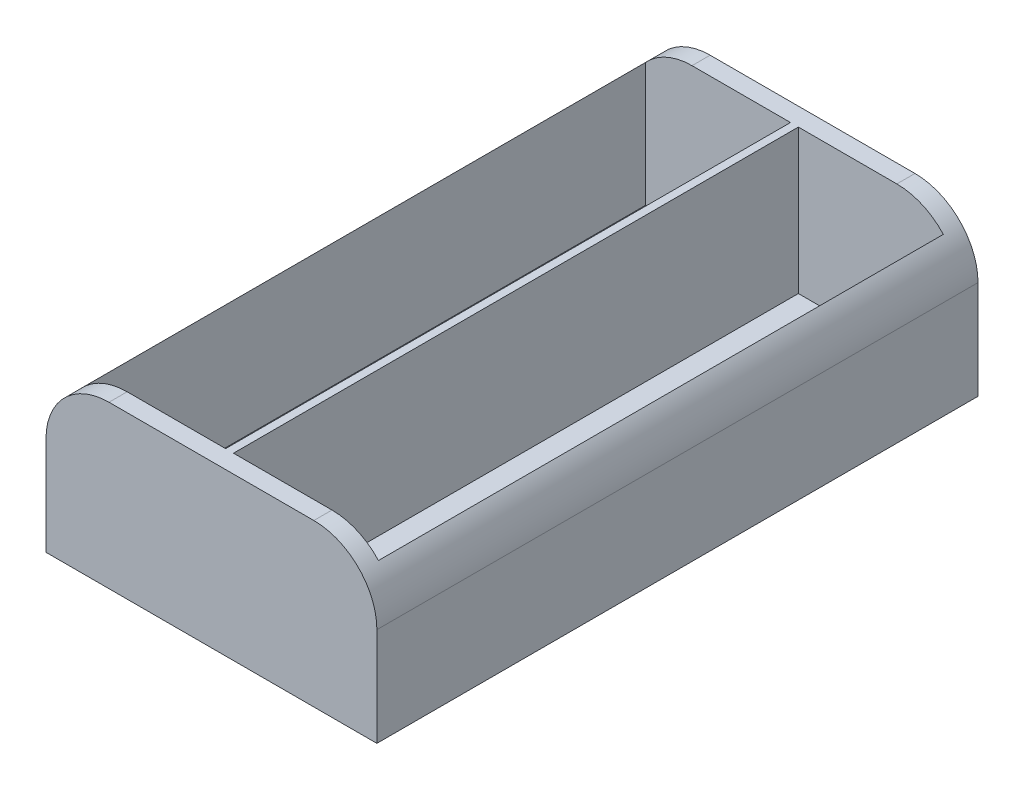
ISO-10303-21;
HEADER;
FILE_DESCRIPTION(('STEP AP214'),'2;1');
FILE_NAME('part.step','',(''),(''),'','','');
FILE_SCHEMA(('AUTOMOTIVE_DESIGN { 1 0 10303 214 1 1 1 1 }'));
ENDSEC;
DATA;
#1=APPLICATION_CONTEXT('core data for automotive mechanical design processes');
#2=APPLICATION_PROTOCOL_DEFINITION('international standard','automotive_design',2000,#1);
#3=PRODUCT_CONTEXT('',#1,'mechanical');
#4=PRODUCT('Part','Part','',(#3));
#5=PRODUCT_RELATED_PRODUCT_CATEGORY('part','',(#4));
#6=PRODUCT_DEFINITION_FORMATION('','',#4);
#7=PRODUCT_DEFINITION_CONTEXT('part definition',#1,'design');
#8=PRODUCT_DEFINITION('design','',#6,#7);
#9=PRODUCT_DEFINITION_SHAPE('','',#8);
#10=(LENGTH_UNIT() NAMED_UNIT(*) SI_UNIT(.MILLI.,.METRE.));
#11=(NAMED_UNIT(*) PLANE_ANGLE_UNIT() SI_UNIT($,.RADIAN.));
#12=(NAMED_UNIT(*) SI_UNIT($,.STERADIAN.) SOLID_ANGLE_UNIT());
#13=UNCERTAINTY_MEASURE_WITH_UNIT(LENGTH_MEASURE(1.E-05),#10,'distance_accuracy_value','');
#14=(GEOMETRIC_REPRESENTATION_CONTEXT(3) GLOBAL_UNCERTAINTY_ASSIGNED_CONTEXT((#13)) GLOBAL_UNIT_ASSIGNED_CONTEXT((#10,
#11,#12)) REPRESENTATION_CONTEXT('',''));
#15=CARTESIAN_POINT('',(0.,0.,0.));
#16=DIRECTION('',(0.,0.,1.));
#17=DIRECTION('',(1.,0.,0.));
#18=AXIS2_PLACEMENT_3D('',#15,#16,#17);
#19=CARTESIAN_POINT('',(0.,2.2,0.));
#20=DIRECTION('',(0.,-1.,0.));
#21=DIRECTION('',(0.,0.,-1.));
#22=AXIS2_PLACEMENT_3D('',#19,#20,#21);
#23=PLANE('',#22);
#24=CARTESIAN_POINT('',(10.5,2.2,0.));
#25=DIRECTION('',(0.,-1.,0.));
#26=DIRECTION('',(0.,0.,-1.));
#27=AXIS2_PLACEMENT_3D('',#24,#25,#26);
#28=CIRCLE('',#27,2.8);
#29=CARTESIAN_POINT('',(10.5,2.2,-2.8));
#30=VERTEX_POINT('',#29);
#31=EDGE_CURVE('E279',#30,#30,#28,.T.);
#32=ORIENTED_EDGE('',*,*,#31,.T.);
#33=EDGE_LOOP('',(#32));
#34=FACE_BOUND('',#33,.T.);
#35=DIRECTION('',(0.,0.,-1.));
#36=VECTOR('',#35,1.);
#37=CARTESIAN_POINT('',(0.499999999999999,2.2,0.));
#38=LINE('',#37,#36);
#39=CARTESIAN_POINT('',(0.5,2.2,35.85));
#40=VERTEX_POINT('',#39);
#41=CARTESIAN_POINT('',(0.5,2.2,-35.85));
#42=VERTEX_POINT('',#41);
#43=EDGE_CURVE('E50',#40,#42,#38,.T.);
#44=ORIENTED_EDGE('',*,*,#43,.F.);
#45=DIRECTION('',(1.,0.,0.));
#46=VECTOR('',#45,1.);
#47=CARTESIAN_POINT('',(18.9,2.2,35.85));
#48=LINE('',#47,#46);
#49=CARTESIAN_POINT('',(18.9,2.2,35.85));
#50=VERTEX_POINT('',#49);
#51=EDGE_CURVE('E191',#40,#50,#48,.T.);
#52=ORIENTED_EDGE('',*,*,#51,.T.);
#53=DIRECTION('',(0.,0.,-1.));
#54=VECTOR('',#53,1.);
#55=CARTESIAN_POINT('',(18.9,2.2,35.85));
#56=LINE('',#55,#54);
#57=CARTESIAN_POINT('',(18.9,2.2,-35.85));
#58=VERTEX_POINT('',#57);
#59=EDGE_CURVE('E199',#50,#58,#56,.T.);
#60=ORIENTED_EDGE('',*,*,#59,.T.);
#61=DIRECTION('',(-1.,0.,0.));
#62=VECTOR('',#61,1.);
#63=CARTESIAN_POINT('',(18.9,2.2,-35.85));
#64=LINE('',#63,#62);
#65=EDGE_CURVE('E202',#58,#42,#64,.T.);
#66=ORIENTED_EDGE('',*,*,#65,.T.);
#67=EDGE_LOOP('',(#44,#52,#60,#66));
#68=FACE_BOUND('',#67,.T.);
#69=ADVANCED_FACE('F35',(#34,#68),#23,.F.);
#70=CARTESIAN_POINT('',(-10.5,2.2,0.));
#71=DIRECTION('',(0.,-1.,0.));
#72=DIRECTION('',(0.,0.,-1.));
#73=AXIS2_PLACEMENT_3D('',#70,#71,#72);
#74=CIRCLE('',#73,2.8);
#75=CARTESIAN_POINT('',(-10.5,2.2,-2.8));
#76=VERTEX_POINT('',#75);
#77=EDGE_CURVE('E11',#76,#76,#74,.T.);
#78=ORIENTED_EDGE('',*,*,#77,.T.);
#79=EDGE_LOOP('',(#78));
#80=FACE_BOUND('',#79,.T.);
#81=DIRECTION('',(0.,0.,1.));
#82=VECTOR('',#81,1.);
#83=CARTESIAN_POINT('',(-0.500000000000001,2.2,0.));
#84=LINE('',#83,#82);
#85=CARTESIAN_POINT('',(-0.5,2.2,-35.85));
#86=VERTEX_POINT('',#85);
#87=CARTESIAN_POINT('',(-0.5,2.2,35.85));
#88=VERTEX_POINT('',#87);
#89=EDGE_CURVE('E176',#86,#88,#84,.T.);
#90=ORIENTED_EDGE('',*,*,#89,.F.);
#91=CARTESIAN_POINT('',(-18.9,2.2,-35.85));
#92=VERTEX_POINT('',#91);
#93=EDGE_CURVE('E169',#86,#92,#64,.T.);
#94=ORIENTED_EDGE('',*,*,#93,.T.);
#95=DIRECTION('',(0.,0.,1.));
#96=VECTOR('',#95,1.);
#97=CARTESIAN_POINT('',(-18.9,2.2,35.85));
#98=LINE('',#97,#96);
#99=CARTESIAN_POINT('',(-18.9,2.2,35.85));
#100=VERTEX_POINT('',#99);
#101=EDGE_CURVE('E204',#92,#100,#98,.T.);
#102=ORIENTED_EDGE('',*,*,#101,.T.);
#103=EDGE_CURVE('E197',#100,#88,#48,.T.);
#104=ORIENTED_EDGE('',*,*,#103,.T.);
#105=EDGE_LOOP('',(#90,#94,#102,#104));
#106=FACE_BOUND('',#105,.T.);
#107=ADVANCED_FACE('F296',(#80,#106),#23,.F.);
#108=CARTESIAN_POINT('',(21.,20.5,35.85));
#109=DIRECTION('',(0.,0.,1.));
#110=DIRECTION('',(1.,0.,0.));
#111=AXIS2_PLACEMENT_3D('',#108,#109,#110);
#112=PLANE('',#111);
#113=DIRECTION('',(0.,-1.,0.));
#114=VECTOR('',#113,1.);
#115=CARTESIAN_POINT('',(0.5,20.5,35.85));
#116=LINE('',#115,#114);
#117=CARTESIAN_POINT('',(0.499999999999997,20.5,35.85));
#118=VERTEX_POINT('',#117);
#119=EDGE_CURVE('E184',#118,#40,#116,.T.);
#120=ORIENTED_EDGE('',*,*,#119,.F.);
#121=DIRECTION('',(1.,0.,0.));
#122=VECTOR('',#121,1.);
#123=CARTESIAN_POINT('',(18.9,20.5,35.85));
#124=LINE('',#123,#122);
#125=CARTESIAN_POINT('',(13.,20.5,35.85));
#126=VERTEX_POINT('',#125);
#127=EDGE_CURVE('E194',#118,#126,#124,.T.);
#128=ORIENTED_EDGE('',*,*,#127,.T.);
#129=CARTESIAN_POINT('',(13.,12.5,35.85));
#130=DIRECTION('',(0.,0.,-1.));
#131=DIRECTION('',(-1.,0.,0.));
#132=AXIS2_PLACEMENT_3D('',#129,#130,#131);
#133=CIRCLE('',#132,8.);
#134=CARTESIAN_POINT('',(18.9,17.902777063696,35.85));
#135=VERTEX_POINT('',#134);
#136=EDGE_CURVE('E220',#135,#126,#133,.F.);
#137=ORIENTED_EDGE('',*,*,#136,.F.);
#138=DIRECTION('',(0.,-1.,0.));
#139=VECTOR('',#138,1.);
#140=CARTESIAN_POINT('',(18.9,20.5,35.85));
#141=LINE('',#140,#139);
#142=EDGE_CURVE('E212',#135,#50,#141,.T.);
#143=ORIENTED_EDGE('',*,*,#142,.T.);
#144=ORIENTED_EDGE('',*,*,#51,.F.);
#145=EDGE_LOOP('',(#120,#128,#137,#143,#144));
#146=FACE_BOUND('',#145,.T.);
#147=ADVANCED_FACE('F303',(#146),#112,.F.);
#148=DIRECTION('',(0.,1.,0.));
#149=VECTOR('',#148,1.);
#150=CARTESIAN_POINT('',(-0.5,20.5,35.85));
#151=LINE('',#150,#149);
#152=CARTESIAN_POINT('',(-0.5,20.5,35.85));
#153=VERTEX_POINT('',#152);
#154=EDGE_CURVE('E58',#88,#153,#151,.T.);
#155=ORIENTED_EDGE('',*,*,#154,.F.);
#156=ORIENTED_EDGE('',*,*,#103,.F.);
#157=DIRECTION('',(0.,-1.,0.));
#158=VECTOR('',#157,1.);
#159=CARTESIAN_POINT('',(-18.9,20.5,35.85));
#160=LINE('',#159,#158);
#161=CARTESIAN_POINT('',(-18.9,17.902777063696,35.85));
#162=VERTEX_POINT('',#161);
#163=EDGE_CURVE('E196',#162,#100,#160,.T.);
#164=ORIENTED_EDGE('',*,*,#163,.F.);
#165=CARTESIAN_POINT('',(-13.,12.5,35.85));
#166=DIRECTION('',(0.,0.,-1.));
#167=DIRECTION('',(-1.,0.,0.));
#168=AXIS2_PLACEMENT_3D('',#165,#166,#167);
#169=CIRCLE('',#168,8.);
#170=CARTESIAN_POINT('',(-13.,20.5,35.85));
#171=VERTEX_POINT('',#170);
#172=EDGE_CURVE('E223',#171,#162,#169,.F.);
#173=ORIENTED_EDGE('',*,*,#172,.F.);
#174=EDGE_CURVE('E162',#171,#153,#124,.T.);
#175=ORIENTED_EDGE('',*,*,#174,.T.);
#176=EDGE_LOOP('',(#155,#156,#164,#173,#175));
#177=FACE_BOUND('',#176,.T.);
#178=ADVANCED_FACE('F349',(#177),#112,.F.);
#179=CARTESIAN_POINT('',(21.,20.5,-35.85));
#180=DIRECTION('',(0.,0.,1.));
#181=DIRECTION('',(1.,0.,0.));
#182=AXIS2_PLACEMENT_3D('',#179,#180,#181);
#183=PLANE('',#182);
#184=DIRECTION('',(-1.,0.,0.));
#185=VECTOR('',#184,1.);
#186=CARTESIAN_POINT('',(18.9,20.5,-35.85));
#187=LINE('',#186,#185);
#188=CARTESIAN_POINT('',(13.,20.5,-35.85));
#189=VERTEX_POINT('',#188);
#190=CARTESIAN_POINT('',(0.499999999999997,20.5,-35.85));
#191=VERTEX_POINT('',#190);
#192=EDGE_CURVE('E161',#189,#191,#187,.T.);
#193=ORIENTED_EDGE('',*,*,#192,.T.);
#194=DIRECTION('',(0.,-1.,0.));
#195=VECTOR('',#194,1.);
#196=CARTESIAN_POINT('',(0.5,20.5,-35.85));
#197=LINE('',#196,#195);
#198=EDGE_CURVE('E172',#191,#42,#197,.T.);
#199=ORIENTED_EDGE('',*,*,#198,.T.);
#200=ORIENTED_EDGE('',*,*,#65,.F.);
#201=DIRECTION('',(0.,-1.,0.));
#202=VECTOR('',#201,1.);
#203=CARTESIAN_POINT('',(18.9,20.5,-35.85));
#204=LINE('',#203,#202);
#205=CARTESIAN_POINT('',(18.9,17.902777063696,-35.85));
#206=VERTEX_POINT('',#205);
#207=EDGE_CURVE('E210',#206,#58,#204,.T.);
#208=ORIENTED_EDGE('',*,*,#207,.F.);
#209=CARTESIAN_POINT('',(13.,12.5,-35.85));
#210=DIRECTION('',(0.,0.,1.));
#211=DIRECTION('',(1.,0.,0.));
#212=AXIS2_PLACEMENT_3D('',#209,#210,#211);
#213=CIRCLE('',#212,8.);
#214=EDGE_CURVE('E215',#189,#206,#213,.F.);
#215=ORIENTED_EDGE('',*,*,#214,.F.);
#216=EDGE_LOOP('',(#193,#199,#200,#208,#215));
#217=FACE_BOUND('',#216,.T.);
#218=ADVANCED_FACE('F346',(#217),#183,.T.);
#219=ORIENTED_EDGE('',*,*,#93,.F.);
#220=DIRECTION('',(0.,1.,0.));
#221=VECTOR('',#220,1.);
#222=CARTESIAN_POINT('',(-0.5,20.5,-35.85));
#223=LINE('',#222,#221);
#224=CARTESIAN_POINT('',(-0.500000000000001,20.5,-35.85));
#225=VERTEX_POINT('',#224);
#226=EDGE_CURVE('E166',#86,#225,#223,.T.);
#227=ORIENTED_EDGE('',*,*,#226,.T.);
#228=CARTESIAN_POINT('',(-13.,20.5,-35.85));
#229=VERTEX_POINT('',#228);
#230=EDGE_CURVE('E150',#225,#229,#187,.T.);
#231=ORIENTED_EDGE('',*,*,#230,.T.);
#232=CARTESIAN_POINT('',(-13.,12.5,-35.85));
#233=DIRECTION('',(0.,0.,1.));
#234=DIRECTION('',(1.,0.,0.));
#235=AXIS2_PLACEMENT_3D('',#232,#233,#234);
#236=CIRCLE('',#235,8.);
#237=CARTESIAN_POINT('',(-18.9,17.902777063696,-35.85));
#238=VERTEX_POINT('',#237);
#239=EDGE_CURVE('E218',#238,#229,#236,.F.);
#240=ORIENTED_EDGE('',*,*,#239,.F.);
#241=DIRECTION('',(0.,-1.,0.));
#242=VECTOR('',#241,1.);
#243=CARTESIAN_POINT('',(-18.9,20.5,-35.85));
#244=LINE('',#243,#242);
#245=EDGE_CURVE('E208',#238,#92,#244,.T.);
#246=ORIENTED_EDGE('',*,*,#245,.T.);
#247=EDGE_LOOP('',(#219,#227,#231,#240,#246));
#248=FACE_BOUND('',#247,.T.);
#249=ADVANCED_FACE('F167',(#248),#183,.T.);
#250=CARTESIAN_POINT('',(0.,20.5,0.));
#251=DIRECTION('',(0.,1.,0.));
#252=DIRECTION('',(0.,0.,1.));
#253=AXIS2_PLACEMENT_3D('',#250,#251,#252);
#254=PLANE('',#253);
#255=DIRECTION('',(0.,0.,-1.));
#256=VECTOR('',#255,1.);
#257=CARTESIAN_POINT('',(0.499999999999999,20.5,38.15));
#258=LINE('',#257,#256);
#259=EDGE_CURVE('E177',#118,#191,#258,.T.);
#260=ORIENTED_EDGE('',*,*,#259,.T.);
#261=ORIENTED_EDGE('',*,*,#192,.F.);
#262=DIRECTION('',(0.,0.,-1.));
#263=VECTOR('',#262,1.);
#264=CARTESIAN_POINT('',(13.,20.5,-38.15));
#265=LINE('',#264,#263);
#266=CARTESIAN_POINT('',(13.,20.5,-38.15));
#267=VERTEX_POINT('',#266);
#268=EDGE_CURVE('E258',#189,#267,#265,.T.);
#269=ORIENTED_EDGE('',*,*,#268,.T.);
#270=DIRECTION('',(-1.,0.,0.));
#271=VECTOR('',#270,1.);
#272=CARTESIAN_POINT('',(21.,20.5,-38.15));
#273=LINE('',#272,#271);
#274=CARTESIAN_POINT('',(-13.,20.5,-38.15));
#275=VERTEX_POINT('',#274);
#276=EDGE_CURVE('E227',#267,#275,#273,.T.);
#277=ORIENTED_EDGE('',*,*,#276,.T.);
#278=DIRECTION('',(0.,0.,-1.));
#279=VECTOR('',#278,1.);
#280=CARTESIAN_POINT('',(-13.,20.5,0.));
#281=LINE('',#280,#279);
#282=EDGE_CURVE('E158',#275,#229,#281,.F.);
#283=ORIENTED_EDGE('',*,*,#282,.T.);
#284=ORIENTED_EDGE('',*,*,#230,.F.);
#285=DIRECTION('',(0.,0.,1.));
#286=VECTOR('',#285,1.);
#287=CARTESIAN_POINT('',(-0.500000000000001,20.5,38.15));
#288=LINE('',#287,#286);
#289=EDGE_CURVE('E156',#225,#153,#288,.T.);
#290=ORIENTED_EDGE('',*,*,#289,.T.);
#291=ORIENTED_EDGE('',*,*,#174,.F.);
#292=CARTESIAN_POINT('',(-13.,20.5,38.15));
#293=VERTEX_POINT('',#292);
#294=EDGE_CURVE('E262',#171,#293,#281,.F.);
#295=ORIENTED_EDGE('',*,*,#294,.T.);
#296=DIRECTION('',(-1.,0.,0.));
#297=VECTOR('',#296,1.);
#298=CARTESIAN_POINT('',(21.,20.5,38.15));
#299=LINE('',#298,#297);
#300=CARTESIAN_POINT('',(13.,20.5,38.15));
#301=VERTEX_POINT('',#300);
#302=EDGE_CURVE('E229',#301,#293,#299,.T.);
#303=ORIENTED_EDGE('',*,*,#302,.F.);
#304=EDGE_CURVE('E259',#301,#126,#265,.T.);
#305=ORIENTED_EDGE('',*,*,#304,.T.);
#306=ORIENTED_EDGE('',*,*,#127,.F.);
#307=EDGE_LOOP('',(#260,#261,#269,#277,#283,#284,#290,#291,#295,#303,#305,#306));
#308=FACE_BOUND('',#307,.T.);
#309=ADVANCED_FACE('F153',(#308),#254,.T.);
#310=CARTESIAN_POINT('',(-13.,12.5,38.15));
#311=DIRECTION('',(0.,0.,-1.));
#312=DIRECTION('',(-1.,0.,0.));
#313=AXIS2_PLACEMENT_3D('',#310,#311,#312);
#314=CYLINDRICAL_SURFACE('',#313,8.);
#315=ORIENTED_EDGE('',*,*,#294,.F.);
#316=ORIENTED_EDGE('',*,*,#172,.T.);
#317=DIRECTION('',(0.,0.,-1.));
#318=VECTOR('',#317,1.);
#319=CARTESIAN_POINT('',(-18.9,17.902777063696,38.15));
#320=LINE('',#319,#318);
#321=EDGE_CURVE('E173',#162,#238,#320,.T.);
#322=ORIENTED_EDGE('',*,*,#321,.T.);
#323=ORIENTED_EDGE('',*,*,#239,.T.);
#324=ORIENTED_EDGE('',*,*,#282,.F.);
#325=CARTESIAN_POINT('',(-13.,12.5,-38.15));
#326=DIRECTION('',(0.,0.,1.));
#327=DIRECTION('',(1.,0.,0.));
#328=AXIS2_PLACEMENT_3D('',#325,#326,#327);
#329=CIRCLE('',#328,8.);
#330=CARTESIAN_POINT('',(-21.,12.5,-38.15));
#331=VERTEX_POINT('',#330);
#332=EDGE_CURVE('E255',#331,#275,#329,.F.);
#333=ORIENTED_EDGE('',*,*,#332,.F.);
#334=DIRECTION('',(0.,0.,-1.));
#335=VECTOR('',#334,1.);
#336=CARTESIAN_POINT('',(-21.,12.5,38.15));
#337=LINE('',#336,#335);
#338=CARTESIAN_POINT('',(-21.,12.5,38.15));
#339=VERTEX_POINT('',#338);
#340=EDGE_CURVE('E250',#339,#331,#337,.T.);
#341=ORIENTED_EDGE('',*,*,#340,.F.);
#342=CARTESIAN_POINT('',(-13.,12.5,38.15));
#343=DIRECTION('',(0.,0.,1.));
#344=DIRECTION('',(1.,0.,0.));
#345=AXIS2_PLACEMENT_3D('',#342,#343,#344);
#346=CIRCLE('',#345,8.);
#347=EDGE_CURVE('E266',#293,#339,#346,.T.);
#348=ORIENTED_EDGE('',*,*,#347,.F.);
#349=EDGE_LOOP('',(#315,#316,#322,#323,#324,#333,#341,#348));
#350=FACE_BOUND('',#349,.T.);
#351=ADVANCED_FACE('F319',(#350),#314,.T.);
#352=CARTESIAN_POINT('',(13.,12.5,0.));
#353=DIRECTION('',(0.,0.,1.));
#354=DIRECTION('',(1.,0.,0.));
#355=AXIS2_PLACEMENT_3D('',#352,#353,#354);
#356=CYLINDRICAL_SURFACE('',#355,8.);
#357=DIRECTION('',(0.,0.,1.));
#358=VECTOR('',#357,1.);
#359=CARTESIAN_POINT('',(18.9,17.902777063696,0.));
#360=LINE('',#359,#358);
#361=EDGE_CURVE('E270',#206,#135,#360,.T.);
#362=ORIENTED_EDGE('',*,*,#361,.T.);
#363=ORIENTED_EDGE('',*,*,#136,.T.);
#364=ORIENTED_EDGE('',*,*,#304,.F.);
#365=CARTESIAN_POINT('',(13.,12.5,38.15));
#366=DIRECTION('',(0.,0.,1.));
#367=DIRECTION('',(1.,0.,0.));
#368=AXIS2_PLACEMENT_3D('',#365,#366,#367);
#369=CIRCLE('',#368,8.);
#370=CARTESIAN_POINT('',(21.,12.5,38.15));
#371=VERTEX_POINT('',#370);
#372=EDGE_CURVE('E264',#371,#301,#369,.T.);
#373=ORIENTED_EDGE('',*,*,#372,.F.);
#374=DIRECTION('',(0.,0.,-1.));
#375=VECTOR('',#374,1.);
#376=CARTESIAN_POINT('',(21.,12.5,38.15));
#377=LINE('',#376,#375);
#378=CARTESIAN_POINT('',(21.,12.5,-38.15));
#379=VERTEX_POINT('',#378);
#380=EDGE_CURVE('E268',#379,#371,#377,.F.);
#381=ORIENTED_EDGE('',*,*,#380,.F.);
#382=CARTESIAN_POINT('',(13.,12.5,-38.15));
#383=DIRECTION('',(0.,0.,1.));
#384=DIRECTION('',(1.,0.,0.));
#385=AXIS2_PLACEMENT_3D('',#382,#383,#384);
#386=CIRCLE('',#385,8.);
#387=EDGE_CURVE('E253',#267,#379,#386,.F.);
#388=ORIENTED_EDGE('',*,*,#387,.F.);
#389=ORIENTED_EDGE('',*,*,#268,.F.);
#390=ORIENTED_EDGE('',*,*,#214,.T.);
#391=EDGE_LOOP('',(#362,#363,#364,#373,#381,#388,#389,#390));
#392=FACE_BOUND('',#391,.T.);
#393=ADVANCED_FACE('F338',(#392),#356,.T.);
#394=CARTESIAN_POINT('',(21.,20.5,38.15));
#395=DIRECTION('',(-1.,0.,0.));
#396=DIRECTION('',(0.,0.,1.));
#397=AXIS2_PLACEMENT_3D('',#394,#395,#396);
#398=PLANE('',#397);
#399=DIRECTION('',(0.,-1.,0.));
#400=VECTOR('',#399,1.);
#401=CARTESIAN_POINT('',(21.,20.5,-38.15));
#402=LINE('',#401,#400);
#403=CARTESIAN_POINT('',(21.,0.,-38.15));
#404=VERTEX_POINT('',#403);
#405=EDGE_CURVE('E248',#379,#404,#402,.T.);
#406=ORIENTED_EDGE('',*,*,#405,.F.);
#407=ORIENTED_EDGE('',*,*,#380,.T.);
#408=DIRECTION('',(0.,-1.,0.));
#409=VECTOR('',#408,1.);
#410=CARTESIAN_POINT('',(21.,20.5,38.15));
#411=LINE('',#410,#409);
#412=CARTESIAN_POINT('',(21.,0.,38.15));
#413=VERTEX_POINT('',#412);
#414=EDGE_CURVE('E232',#371,#413,#411,.T.);
#415=ORIENTED_EDGE('',*,*,#414,.T.);
#416=DIRECTION('',(0.,0.,-1.));
#417=VECTOR('',#416,1.);
#418=CARTESIAN_POINT('',(21.,0.,38.15));
#419=LINE('',#418,#417);
#420=EDGE_CURVE('E226',#413,#404,#419,.T.);
#421=ORIENTED_EDGE('',*,*,#420,.T.);
#422=EDGE_LOOP('',(#406,#407,#415,#421));
#423=FACE_BOUND('',#422,.T.);
#424=ADVANCED_FACE('F334',(#423),#398,.F.);
#425=CARTESIAN_POINT('',(21.,20.5,-38.15));
#426=DIRECTION('',(0.,0.,1.));
#427=DIRECTION('',(1.,0.,0.));
#428=AXIS2_PLACEMENT_3D('',#425,#426,#427);
#429=PLANE('',#428);
#430=ORIENTED_EDGE('',*,*,#332,.T.);
#431=ORIENTED_EDGE('',*,*,#276,.F.);
#432=ORIENTED_EDGE('',*,*,#387,.T.);
#433=ORIENTED_EDGE('',*,*,#405,.T.);
#434=DIRECTION('',(-1.,0.,0.));
#435=VECTOR('',#434,1.);
#436=CARTESIAN_POINT('',(21.,0.,-38.15));
#437=LINE('',#436,#435);
#438=CARTESIAN_POINT('',(-21.,0.,-38.15));
#439=VERTEX_POINT('',#438);
#440=EDGE_CURVE('E235',#404,#439,#437,.T.);
#441=ORIENTED_EDGE('',*,*,#440,.T.);
#442=DIRECTION('',(0.,-1.,0.));
#443=VECTOR('',#442,1.);
#444=CARTESIAN_POINT('',(-21.,20.5,-38.15));
#445=LINE('',#444,#443);
#446=EDGE_CURVE('E245',#331,#439,#445,.T.);
#447=ORIENTED_EDGE('',*,*,#446,.F.);
#448=EDGE_LOOP('',(#430,#431,#432,#433,#441,#447));
#449=FACE_BOUND('',#448,.T.);
#450=ADVANCED_FACE('F330',(#449),#429,.F.);
#451=CARTESIAN_POINT('',(-21.,20.5,38.15));
#452=DIRECTION('',(-1.,0.,0.));
#453=DIRECTION('',(0.,0.,1.));
#454=AXIS2_PLACEMENT_3D('',#451,#452,#453);
#455=PLANE('',#454);
#456=DIRECTION('',(0.,-1.,0.));
#457=VECTOR('',#456,1.);
#458=CARTESIAN_POINT('',(-21.,20.5,38.15));
#459=LINE('',#458,#457);
#460=CARTESIAN_POINT('',(-21.,0.,38.15));
#461=VERTEX_POINT('',#460);
#462=EDGE_CURVE('E242',#339,#461,#459,.T.);
#463=ORIENTED_EDGE('',*,*,#462,.F.);
#464=ORIENTED_EDGE('',*,*,#340,.T.);
#465=ORIENTED_EDGE('',*,*,#446,.T.);
#466=DIRECTION('',(0.,0.,-1.));
#467=VECTOR('',#466,1.);
#468=CARTESIAN_POINT('',(-21.,0.,38.15));
#469=LINE('',#468,#467);
#470=EDGE_CURVE('E237',#461,#439,#469,.T.);
#471=ORIENTED_EDGE('',*,*,#470,.F.);
#472=EDGE_LOOP('',(#463,#464,#465,#471));
#473=FACE_BOUND('',#472,.T.);
#474=ADVANCED_FACE('F326',(#473),#455,.T.);
#475=CARTESIAN_POINT('',(21.,20.5,38.15));
#476=DIRECTION('',(0.,0.,1.));
#477=DIRECTION('',(1.,0.,0.));
#478=AXIS2_PLACEMENT_3D('',#475,#476,#477);
#479=PLANE('',#478);
#480=ORIENTED_EDGE('',*,*,#462,.T.);
#481=DIRECTION('',(-1.,0.,0.));
#482=VECTOR('',#481,1.);
#483=CARTESIAN_POINT('',(21.,0.,38.15));
#484=LINE('',#483,#482);
#485=EDGE_CURVE('E230',#413,#461,#484,.T.);
#486=ORIENTED_EDGE('',*,*,#485,.F.);
#487=ORIENTED_EDGE('',*,*,#414,.F.);
#488=ORIENTED_EDGE('',*,*,#372,.T.);
#489=ORIENTED_EDGE('',*,*,#302,.T.);
#490=ORIENTED_EDGE('',*,*,#347,.T.);
#491=EDGE_LOOP('',(#480,#486,#487,#488,#489,#490));
#492=FACE_BOUND('',#491,.T.);
#493=ADVANCED_FACE('F322',(#492),#479,.T.);
#494=CARTESIAN_POINT('',(0.,0.,0.));
#495=DIRECTION('',(0.,1.,0.));
#496=DIRECTION('',(0.,0.,1.));
#497=AXIS2_PLACEMENT_3D('',#494,#495,#496);
#498=PLANE('',#497);
#499=ORIENTED_EDGE('',*,*,#470,.T.);
#500=ORIENTED_EDGE('',*,*,#440,.F.);
#501=ORIENTED_EDGE('',*,*,#420,.F.);
#502=ORIENTED_EDGE('',*,*,#485,.T.);
#503=EDGE_LOOP('',(#499,#500,#501,#502));
#504=FACE_BOUND('',#503,.T.);
#505=CARTESIAN_POINT('',(-10.5,0.,0.));
#506=DIRECTION('',(0.,1.,0.));
#507=DIRECTION('',(0.,0.,1.));
#508=AXIS2_PLACEMENT_3D('',#505,#506,#507);
#509=CIRCLE('',#508,1.5);
#510=CARTESIAN_POINT('',(-10.5,0.,1.49999999999999));
#511=VERTEX_POINT('',#510);
#512=EDGE_CURVE('E187',#511,#511,#509,.T.);
#513=ORIENTED_EDGE('',*,*,#512,.T.);
#514=EDGE_LOOP('',(#513));
#515=FACE_BOUND('',#514,.T.);
#516=CARTESIAN_POINT('',(10.5,0.,0.));
#517=DIRECTION('',(0.,1.,0.));
#518=DIRECTION('',(0.,0.,1.));
#519=AXIS2_PLACEMENT_3D('',#516,#517,#518);
#520=CIRCLE('',#519,1.5);
#521=CARTESIAN_POINT('',(10.5,0.,1.49999999999999));
#522=VERTEX_POINT('',#521);
#523=EDGE_CURVE('E188',#522,#522,#520,.T.);
#524=ORIENTED_EDGE('',*,*,#523,.T.);
#525=EDGE_LOOP('',(#524));
#526=FACE_BOUND('',#525,.T.);
#527=ADVANCED_FACE('F315',(#504,#515,#526),#498,.F.);
#528=CARTESIAN_POINT('',(18.9,20.5,35.85));
#529=DIRECTION('',(-1.,0.,0.));
#530=DIRECTION('',(0.,0.,1.));
#531=AXIS2_PLACEMENT_3D('',#528,#529,#530);
#532=PLANE('',#531);
#533=ORIENTED_EDGE('',*,*,#207,.T.);
#534=ORIENTED_EDGE('',*,*,#59,.F.);
#535=ORIENTED_EDGE('',*,*,#142,.F.);
#536=ORIENTED_EDGE('',*,*,#361,.F.);
#537=EDGE_LOOP('',(#533,#534,#535,#536));
#538=FACE_BOUND('',#537,.T.);
#539=ADVANCED_FACE('F311',(#538),#532,.T.);
#540=CARTESIAN_POINT('',(-18.9,20.5,35.85));
#541=DIRECTION('',(1.,0.,0.));
#542=DIRECTION('',(0.,0.,-1.));
#543=AXIS2_PLACEMENT_3D('',#540,#541,#542);
#544=PLANE('',#543);
#545=ORIENTED_EDGE('',*,*,#163,.T.);
#546=ORIENTED_EDGE('',*,*,#101,.F.);
#547=ORIENTED_EDGE('',*,*,#245,.F.);
#548=ORIENTED_EDGE('',*,*,#321,.F.);
#549=EDGE_LOOP('',(#545,#546,#547,#548));
#550=FACE_BOUND('',#549,.T.);
#551=ADVANCED_FACE('F308',(#550),#544,.T.);
#552=CARTESIAN_POINT('',(-10.5,20.5,0.));
#553=DIRECTION('',(0.,-1.,0.));
#554=DIRECTION('',(0.,0.,-1.));
#555=AXIS2_PLACEMENT_3D('',#552,#553,#554);
#556=CYLINDRICAL_SURFACE('',#555,1.5);
#557=CARTESIAN_POINT('',(-10.5,0.900000000000012,0.));
#558=DIRECTION('',(0.,-1.,0.));
#559=DIRECTION('',(0.,0.,-1.));
#560=AXIS2_PLACEMENT_3D('',#557,#558,#559);
#561=CIRCLE('',#560,1.5);
#562=CARTESIAN_POINT('',(-10.5,0.900000000000012,-1.50000000000001));
#563=VERTEX_POINT('',#562);
#564=EDGE_CURVE('E43',#563,#563,#561,.F.);
#565=ORIENTED_EDGE('',*,*,#564,.T.);
#566=EDGE_LOOP('',(#565));
#567=FACE_BOUND('',#566,.T.);
#568=ORIENTED_EDGE('',*,*,#512,.F.);
#569=EDGE_LOOP('',(#568));
#570=FACE_BOUND('',#569,.T.);
#571=ADVANCED_FACE('F284',(#567,#570),#556,.F.);
#572=CARTESIAN_POINT('',(10.5,20.5,0.));
#573=DIRECTION('',(0.,-1.,0.));
#574=DIRECTION('',(0.,0.,-1.));
#575=AXIS2_PLACEMENT_3D('',#572,#573,#574);
#576=CYLINDRICAL_SURFACE('',#575,1.5);
#577=CARTESIAN_POINT('',(10.5,0.900000000000012,0.));
#578=DIRECTION('',(0.,-1.,0.));
#579=DIRECTION('',(0.,0.,-1.));
#580=AXIS2_PLACEMENT_3D('',#577,#578,#579);
#581=CIRCLE('',#580,1.5);
#582=CARTESIAN_POINT('',(10.5,0.900000000000012,-1.50000000000001));
#583=VERTEX_POINT('',#582);
#584=EDGE_CURVE('E276',#583,#583,#581,.F.);
#585=ORIENTED_EDGE('',*,*,#584,.T.);
#586=EDGE_LOOP('',(#585));
#587=FACE_BOUND('',#586,.T.);
#588=ORIENTED_EDGE('',*,*,#523,.F.);
#589=EDGE_LOOP('',(#588));
#590=FACE_BOUND('',#589,.T.);
#591=ADVANCED_FACE('F395',(#587,#590),#576,.F.);
#592=CARTESIAN_POINT('',(0.499999999999999,20.5,38.15));
#593=DIRECTION('',(-1.,0.,0.));
#594=DIRECTION('',(0.,0.,1.));
#595=AXIS2_PLACEMENT_3D('',#592,#593,#594);
#596=PLANE('',#595);
#597=ORIENTED_EDGE('',*,*,#259,.F.);
#598=ORIENTED_EDGE('',*,*,#119,.T.);
#599=ORIENTED_EDGE('',*,*,#43,.T.);
#600=ORIENTED_EDGE('',*,*,#198,.F.);
#601=EDGE_LOOP('',(#597,#598,#599,#600));
#602=FACE_BOUND('',#601,.T.);
#603=ADVANCED_FACE('F364',(#602),#596,.F.);
#604=CARTESIAN_POINT('',(-0.500000000000001,20.5,38.15));
#605=DIRECTION('',(1.,0.,0.));
#606=DIRECTION('',(0.,0.,-1.));
#607=AXIS2_PLACEMENT_3D('',#604,#605,#606);
#608=PLANE('',#607);
#609=ORIENTED_EDGE('',*,*,#89,.T.);
#610=ORIENTED_EDGE('',*,*,#154,.T.);
#611=ORIENTED_EDGE('',*,*,#289,.F.);
#612=ORIENTED_EDGE('',*,*,#226,.F.);
#613=EDGE_LOOP('',(#609,#610,#611,#612));
#614=FACE_BOUND('',#613,.T.);
#615=ADVANCED_FACE('F175',(#614),#608,.F.);
#616=CARTESIAN_POINT('',(10.5,0.900000000000012,0.));
#617=DIRECTION('',(0.,1.,0.));
#618=DIRECTION('',(0.,0.,1.));
#619=AXIS2_PLACEMENT_3D('',#616,#617,#618);
#620=CONICAL_SURFACE('',#619,1.5,0.785398163397452);
#621=ORIENTED_EDGE('',*,*,#31,.F.);
#622=EDGE_LOOP('',(#621));
#623=FACE_BOUND('',#622,.T.);
#624=ORIENTED_EDGE('',*,*,#584,.F.);
#625=EDGE_LOOP('',(#624));
#626=FACE_BOUND('',#625,.T.);
#627=ADVANCED_FACE('F288',(#623,#626),#620,.F.);
#628=CARTESIAN_POINT('',(-10.5,0.900000000000012,0.));
#629=DIRECTION('',(0.,1.,0.));
#630=DIRECTION('',(0.,0.,1.));
#631=AXIS2_PLACEMENT_3D('',#628,#629,#630);
#632=CONICAL_SURFACE('',#631,1.5,0.785398163397452);
#633=ORIENTED_EDGE('',*,*,#77,.F.);
#634=EDGE_LOOP('',(#633));
#635=FACE_BOUND('',#634,.T.);
#636=ORIENTED_EDGE('',*,*,#564,.F.);
#637=EDGE_LOOP('',(#636));
#638=FACE_BOUND('',#637,.T.);
#639=ADVANCED_FACE('F37',(#635,#638),#632,.F.);
#640=CLOSED_SHELL('',(#69,#107,#147,#178,#218,#249,#309,#351,#393,#424,#450,#474,#493,#527,#539,
#551,#571,#591,#603,#615,#627,#639));
#641=MANIFOLD_SOLID_BREP('B2',#640);
#642=ADVANCED_BREP_SHAPE_REPRESENTATION('',(#18,#641),#14);
#643=SHAPE_DEFINITION_REPRESENTATION(#9,#642);
ENDSEC;
END-ISO-10303-21;
